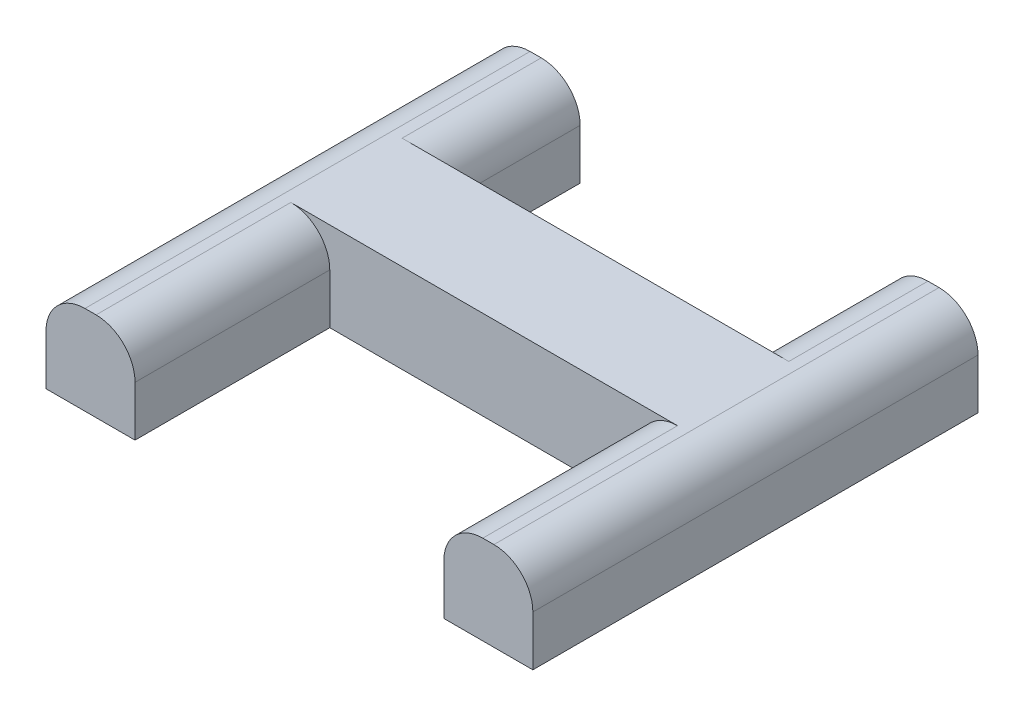
ISO-10303-21;
HEADER;
FILE_DESCRIPTION(('STEP AP214'),'2;1');
FILE_NAME('part.step','',(''),(''),'','','');
FILE_SCHEMA(('AUTOMOTIVE_DESIGN { 1 0 10303 214 1 1 1 1 }'));
ENDSEC;
DATA;
#1=APPLICATION_CONTEXT('core data for automotive mechanical design processes');
#2=APPLICATION_PROTOCOL_DEFINITION('international standard','automotive_design',2000,#1);
#3=PRODUCT_CONTEXT('',#1,'mechanical');
#4=PRODUCT('Part','Part','',(#3));
#5=PRODUCT_RELATED_PRODUCT_CATEGORY('part','',(#4));
#6=PRODUCT_DEFINITION_FORMATION('','',#4);
#7=PRODUCT_DEFINITION_CONTEXT('part definition',#1,'design');
#8=PRODUCT_DEFINITION('design','',#6,#7);
#9=PRODUCT_DEFINITION_SHAPE('','',#8);
#10=(LENGTH_UNIT() NAMED_UNIT(*) SI_UNIT(.MILLI.,.METRE.));
#11=(NAMED_UNIT(*) PLANE_ANGLE_UNIT() SI_UNIT($,.RADIAN.));
#12=(NAMED_UNIT(*) SI_UNIT($,.STERADIAN.) SOLID_ANGLE_UNIT());
#13=UNCERTAINTY_MEASURE_WITH_UNIT(LENGTH_MEASURE(1.E-05),#10,'distance_accuracy_value','');
#14=(GEOMETRIC_REPRESENTATION_CONTEXT(3) GLOBAL_UNCERTAINTY_ASSIGNED_CONTEXT((#13)) GLOBAL_UNIT_ASSIGNED_CONTEXT((#10,
#11,#12)) REPRESENTATION_CONTEXT('',''));
#15=CARTESIAN_POINT('',(0.,0.,0.));
#16=DIRECTION('',(0.,0.,1.));
#17=DIRECTION('',(1.,0.,0.));
#18=AXIS2_PLACEMENT_3D('',#15,#16,#17);
#19=CARTESIAN_POINT('',(0.160971790732811,-0.0999999999999982,2.));
#20=DIRECTION('',(0.,0.,-1.));
#21=DIRECTION('',(-1.,0.,0.));
#22=AXIS2_PLACEMENT_3D('',#19,#20,#21);
#23=CYLINDRICAL_SURFACE('',#22,0.7);
#24=CARTESIAN_POINT('',(0.160971790732811,-0.0999999999999982,5.5));
#25=DIRECTION('',(0.,0.,1.));
#26=DIRECTION('',(-1.,0.,0.));
#27=AXIS2_PLACEMENT_3D('',#24,#25,#26);
#28=CIRCLE('',#27,0.7);
#29=CARTESIAN_POINT('',(0.860971790732811,-0.0999999999999982,5.5));
#30=VERTEX_POINT('',#29);
#31=CARTESIAN_POINT('',(0.160971790732811,0.6,5.5));
#32=VERTEX_POINT('',#31);
#33=EDGE_CURVE('E268',#30,#32,#28,.T.);
#34=ORIENTED_EDGE('',*,*,#33,.F.);
#35=DIRECTION('',(0.,0.,1.));
#36=VECTOR('',#35,1.);
#37=CARTESIAN_POINT('',(0.860971790732811,-0.0999999999999982,5.5));
#38=LINE('',#37,#36);
#39=CARTESIAN_POINT('',(0.860971790732811,-0.0999999999999982,2.));
#40=VERTEX_POINT('',#39);
#41=EDGE_CURVE('E189',#40,#30,#38,.T.);
#42=ORIENTED_EDGE('',*,*,#41,.F.);
#43=CARTESIAN_POINT('',(0.160971790732811,-0.0999999999999982,2.));
#44=DIRECTION('',(0.,0.,-1.));
#45=DIRECTION('',(1.,0.,0.));
#46=AXIS2_PLACEMENT_3D('',#43,#44,#45);
#47=CIRCLE('',#46,0.7);
#48=CARTESIAN_POINT('',(0.160971790732811,0.6,2.));
#49=VERTEX_POINT('',#48);
#50=EDGE_CURVE('E187',#49,#40,#47,.T.);
#51=ORIENTED_EDGE('',*,*,#50,.F.);
#52=DIRECTION('',(0.,0.,-1.));
#53=VECTOR('',#52,1.);
#54=CARTESIAN_POINT('',(0.160971790732811,0.6,2.));
#55=LINE('',#54,#53);
#56=EDGE_CURVE('E170',#32,#49,#55,.T.);
#57=ORIENTED_EDGE('',*,*,#56,.F.);
#58=EDGE_LOOP('',(#34,#42,#51,#57));
#59=FACE_BOUND('',#58,.T.);
#60=ADVANCED_FACE('F16',(#59),#23,.T.);
#61=CARTESIAN_POINT('',(-0.0390282092671897,-0.0999999999999982,2.));
#62=DIRECTION('',(0.,0.,-1.));
#63=DIRECTION('',(-1.,0.,0.));
#64=AXIS2_PLACEMENT_3D('',#61,#62,#63);
#65=CYLINDRICAL_SURFACE('',#64,0.7);
#66=CARTESIAN_POINT('',(-0.0390282092671897,-0.0999999999999982,5.5));
#67=DIRECTION('',(0.,0.,1.));
#68=DIRECTION('',(-1.,0.,0.));
#69=AXIS2_PLACEMENT_3D('',#66,#67,#68);
#70=CIRCLE('',#69,0.7);
#71=CARTESIAN_POINT('',(-0.0390282092671897,0.6,5.5));
#72=VERTEX_POINT('',#71);
#73=CARTESIAN_POINT('',(-0.73902820926719,-0.0999999999999983,5.5));
#74=VERTEX_POINT('',#73);
#75=EDGE_CURVE('E271',#72,#74,#70,.T.);
#76=ORIENTED_EDGE('',*,*,#75,.F.);
#77=DIRECTION('',(0.,0.,1.));
#78=VECTOR('',#77,1.);
#79=CARTESIAN_POINT('',(-0.0390282092671897,0.6,2.));
#80=LINE('',#79,#78);
#81=CARTESIAN_POINT('',(-0.0390282092671899,0.6,-2.5));
#82=VERTEX_POINT('',#81);
#83=EDGE_CURVE('E245',#82,#72,#80,.T.);
#84=ORIENTED_EDGE('',*,*,#83,.F.);
#85=CARTESIAN_POINT('',(-0.0390282092671897,-0.0999999999999982,-2.5));
#86=DIRECTION('',(0.,0.,-1.));
#87=DIRECTION('',(-1.,0.,0.));
#88=AXIS2_PLACEMENT_3D('',#85,#86,#87);
#89=CIRCLE('',#88,0.7);
#90=CARTESIAN_POINT('',(-0.73902820926719,-0.0999999999999983,-2.5));
#91=VERTEX_POINT('',#90);
#92=EDGE_CURVE('E10',#91,#82,#89,.T.);
#93=ORIENTED_EDGE('',*,*,#92,.F.);
#94=DIRECTION('',(0.,0.,-1.));
#95=VECTOR('',#94,1.);
#96=CARTESIAN_POINT('',(-0.73902820926719,-0.0999999999999983,2.));
#97=LINE('',#96,#95);
#98=EDGE_CURVE('E283',#74,#91,#97,.T.);
#99=ORIENTED_EDGE('',*,*,#98,.F.);
#100=EDGE_LOOP('',(#76,#84,#93,#99));
#101=FACE_BOUND('',#100,.T.);
#102=ADVANCED_FACE('F374',(#101),#65,.T.);
#103=CARTESIAN_POINT('',(0.160971790732811,-0.0999999999999982,-2.5));
#104=DIRECTION('',(0.,0.,1.));
#105=DIRECTION('',(1.,0.,0.));
#106=AXIS2_PLACEMENT_3D('',#103,#104,#105);
#107=CYLINDRICAL_SURFACE('',#106,0.7);
#108=CARTESIAN_POINT('',(0.160971790732811,-0.0999999999999982,-2.5));
#109=DIRECTION('',(0.,0.,-1.));
#110=DIRECTION('',(-1.,0.,0.));
#111=AXIS2_PLACEMENT_3D('',#108,#109,#110);
#112=CIRCLE('',#111,0.7);
#113=CARTESIAN_POINT('',(0.16097179073281,0.6,-2.5));
#114=VERTEX_POINT('',#113);
#115=CARTESIAN_POINT('',(0.86097179073281,-0.0999999999999981,-2.5));
#116=VERTEX_POINT('',#115);
#117=EDGE_CURVE('E27',#114,#116,#112,.T.);
#118=ORIENTED_EDGE('',*,*,#117,.F.);
#119=DIRECTION('',(0.,0.,-1.));
#120=VECTOR('',#119,1.);
#121=CARTESIAN_POINT('',(0.160971790732811,0.6,2.));
#122=LINE('',#121,#120);
#123=CARTESIAN_POINT('',(0.160971790732811,0.6,0.));
#124=VERTEX_POINT('',#123);
#125=EDGE_CURVE('E261',#124,#114,#122,.T.);
#126=ORIENTED_EDGE('',*,*,#125,.F.);
#127=CARTESIAN_POINT('',(0.160971790732811,-0.0999999999999982,0.));
#128=DIRECTION('',(0.,0.,1.));
#129=DIRECTION('',(1.,0.,0.));
#130=AXIS2_PLACEMENT_3D('',#127,#128,#129);
#131=CIRCLE('',#130,0.7);
#132=CARTESIAN_POINT('',(0.86097179073281,-0.0999999999999981,0.));
#133=VERTEX_POINT('',#132);
#134=EDGE_CURVE('E222',#133,#124,#131,.T.);
#135=ORIENTED_EDGE('',*,*,#134,.F.);
#136=DIRECTION('',(0.,0.,1.));
#137=VECTOR('',#136,1.);
#138=CARTESIAN_POINT('',(0.86097179073281,-0.0999999999999981,-2.5));
#139=LINE('',#138,#137);
#140=EDGE_CURVE('E297',#116,#133,#139,.T.);
#141=ORIENTED_EDGE('',*,*,#140,.F.);
#142=EDGE_LOOP('',(#118,#126,#135,#141));
#143=FACE_BOUND('',#142,.T.);
#144=ADVANCED_FACE('F441',(#143),#107,.T.);
#145=CARTESIAN_POINT('',(7.11097179073281,-0.0999999999999982,5.5));
#146=DIRECTION('',(0.,0.,-1.));
#147=DIRECTION('',(-1.,0.,0.));
#148=AXIS2_PLACEMENT_3D('',#145,#146,#147);
#149=CYLINDRICAL_SURFACE('',#148,0.7);
#150=CARTESIAN_POINT('',(7.11097179073281,-0.0999999999999982,5.5));
#151=DIRECTION('',(0.,0.,1.));
#152=DIRECTION('',(1.,0.,0.));
#153=AXIS2_PLACEMENT_3D('',#150,#151,#152);
#154=CIRCLE('',#153,0.7);
#155=CARTESIAN_POINT('',(7.11097179073281,0.6,5.5));
#156=VERTEX_POINT('',#155);
#157=CARTESIAN_POINT('',(6.41097179073281,-0.0999999999999982,5.5));
#158=VERTEX_POINT('',#157);
#159=EDGE_CURVE('E390',#156,#158,#154,.T.);
#160=ORIENTED_EDGE('',*,*,#159,.F.);
#161=DIRECTION('',(0.,0.,1.));
#162=VECTOR('',#161,1.);
#163=CARTESIAN_POINT('',(7.11097179073281,0.6,2.));
#164=LINE('',#163,#162);
#165=CARTESIAN_POINT('',(7.11097179073281,0.6,2.));
#166=VERTEX_POINT('',#165);
#167=EDGE_CURVE('E184',#166,#156,#164,.T.);
#168=ORIENTED_EDGE('',*,*,#167,.F.);
#169=CARTESIAN_POINT('',(7.11097179073281,-0.0999999999999982,2.));
#170=DIRECTION('',(0.,0.,-1.));
#171=DIRECTION('',(1.,0.,0.));
#172=AXIS2_PLACEMENT_3D('',#169,#170,#171);
#173=CIRCLE('',#172,0.7);
#174=CARTESIAN_POINT('',(6.41097179073281,-0.0999999999999982,2.));
#175=VERTEX_POINT('',#174);
#176=EDGE_CURVE('E200',#175,#166,#173,.T.);
#177=ORIENTED_EDGE('',*,*,#176,.F.);
#178=DIRECTION('',(0.,0.,-1.));
#179=VECTOR('',#178,1.);
#180=CARTESIAN_POINT('',(6.41097179073281,-0.0999999999999982,5.5));
#181=LINE('',#180,#179);
#182=EDGE_CURVE('E212',#158,#175,#181,.T.);
#183=ORIENTED_EDGE('',*,*,#182,.F.);
#184=EDGE_LOOP('',(#160,#168,#177,#183));
#185=FACE_BOUND('',#184,.T.);
#186=ADVANCED_FACE('F462',(#185),#149,.T.);
#187=CARTESIAN_POINT('',(7.11097179073281,-0.0999999999999982,2.));
#188=DIRECTION('',(0.,0.,1.));
#189=DIRECTION('',(1.,0.,0.));
#190=AXIS2_PLACEMENT_3D('',#187,#188,#189);
#191=CYLINDRICAL_SURFACE('',#190,0.7);
#192=CARTESIAN_POINT('',(7.11097179073281,-0.0999999999999982,-2.5));
#193=DIRECTION('',(0.,0.,-1.));
#194=DIRECTION('',(-1.,0.,0.));
#195=AXIS2_PLACEMENT_3D('',#192,#193,#194);
#196=CIRCLE('',#195,0.7);
#197=CARTESIAN_POINT('',(6.41097179073281,-0.0999999999999982,-2.5));
#198=VERTEX_POINT('',#197);
#199=CARTESIAN_POINT('',(7.11097179073281,0.6,-2.5));
#200=VERTEX_POINT('',#199);
#201=EDGE_CURVE('E385',#198,#200,#196,.T.);
#202=ORIENTED_EDGE('',*,*,#201,.F.);
#203=DIRECTION('',(0.,0.,-1.));
#204=VECTOR('',#203,1.);
#205=CARTESIAN_POINT('',(6.41097179073281,-0.0999999999999982,-2.5));
#206=LINE('',#205,#204);
#207=CARTESIAN_POINT('',(6.41097179073281,-0.0999999999999982,0.));
#208=VERTEX_POINT('',#207);
#209=EDGE_CURVE('E127',#208,#198,#206,.T.);
#210=ORIENTED_EDGE('',*,*,#209,.F.);
#211=CARTESIAN_POINT('',(7.11097179073281,-0.0999999999999982,0.));
#212=DIRECTION('',(0.,0.,1.));
#213=DIRECTION('',(1.,0.,0.));
#214=AXIS2_PLACEMENT_3D('',#211,#212,#213);
#215=CIRCLE('',#214,0.7);
#216=CARTESIAN_POINT('',(7.11097179073281,0.6,0.));
#217=VERTEX_POINT('',#216);
#218=EDGE_CURVE('E221',#217,#208,#215,.T.);
#219=ORIENTED_EDGE('',*,*,#218,.F.);
#220=DIRECTION('',(0.,0.,1.));
#221=VECTOR('',#220,1.);
#222=CARTESIAN_POINT('',(7.11097179073281,0.6,2.));
#223=LINE('',#222,#221);
#224=EDGE_CURVE('E258',#200,#217,#223,.T.);
#225=ORIENTED_EDGE('',*,*,#224,.F.);
#226=EDGE_LOOP('',(#202,#210,#219,#225));
#227=FACE_BOUND('',#226,.T.);
#228=ADVANCED_FACE('F574',(#227),#191,.T.);
#229=CARTESIAN_POINT('',(7.31097179073281,-0.0999999999999982,2.));
#230=DIRECTION('',(0.,0.,-1.));
#231=DIRECTION('',(-1.,0.,0.));
#232=AXIS2_PLACEMENT_3D('',#229,#230,#231);
#233=CYLINDRICAL_SURFACE('',#232,0.7);
#234=CARTESIAN_POINT('',(7.31097179073281,-0.0999999999999982,5.5));
#235=DIRECTION('',(0.,0.,1.));
#236=DIRECTION('',(1.,0.,0.));
#237=AXIS2_PLACEMENT_3D('',#234,#235,#236);
#238=CIRCLE('',#237,0.7);
#239=CARTESIAN_POINT('',(8.01097179073281,-0.0999999999999982,5.5));
#240=VERTEX_POINT('',#239);
#241=CARTESIAN_POINT('',(7.31097179073281,0.6,5.5));
#242=VERTEX_POINT('',#241);
#243=EDGE_CURVE('E20',#240,#242,#238,.T.);
#244=ORIENTED_EDGE('',*,*,#243,.F.);
#245=DIRECTION('',(0.,0.,1.));
#246=VECTOR('',#245,1.);
#247=CARTESIAN_POINT('',(8.01097179073281,-0.0999999999999982,2.));
#248=LINE('',#247,#246);
#249=CARTESIAN_POINT('',(8.01097179073281,-0.0999999999999982,-2.5));
#250=VERTEX_POINT('',#249);
#251=EDGE_CURVE('E254',#250,#240,#248,.T.);
#252=ORIENTED_EDGE('',*,*,#251,.F.);
#253=CARTESIAN_POINT('',(7.31097179073281,-0.0999999999999982,-2.5));
#254=DIRECTION('',(0.,0.,-1.));
#255=DIRECTION('',(-1.,0.,0.));
#256=AXIS2_PLACEMENT_3D('',#253,#254,#255);
#257=CIRCLE('',#256,0.7);
#258=CARTESIAN_POINT('',(7.31097179073281,0.6,-2.5));
#259=VERTEX_POINT('',#258);
#260=EDGE_CURVE('E278',#259,#250,#257,.T.);
#261=ORIENTED_EDGE('',*,*,#260,.F.);
#262=DIRECTION('',(0.,0.,-1.));
#263=VECTOR('',#262,1.);
#264=CARTESIAN_POINT('',(7.31097179073281,0.6,2.));
#265=LINE('',#264,#263);
#266=EDGE_CURVE('E381',#242,#259,#265,.T.);
#267=ORIENTED_EDGE('',*,*,#266,.F.);
#268=EDGE_LOOP('',(#244,#252,#261,#267));
#269=FACE_BOUND('',#268,.T.);
#270=ADVANCED_FACE('F467',(#269),#233,.T.);
#271=CARTESIAN_POINT('',(0.,0.,-2.5));
#272=DIRECTION('',(0.,0.,-1.));
#273=DIRECTION('',(0.,-1.,0.));
#274=AXIS2_PLACEMENT_3D('',#271,#272,#273);
#275=PLANE('',#274);
#276=DIRECTION('',(1.,0.,0.));
#277=VECTOR('',#276,1.);
#278=CARTESIAN_POINT('',(-0.73902820926719,0.6,-2.5));
#279=LINE('',#278,#277);
#280=EDGE_CURVE('E248',#82,#114,#279,.T.);
#281=ORIENTED_EDGE('',*,*,#280,.T.);
#282=ORIENTED_EDGE('',*,*,#117,.T.);
#283=DIRECTION('',(0.,-1.,0.));
#284=VECTOR('',#283,1.);
#285=CARTESIAN_POINT('',(0.860971790732811,-1.,-2.5));
#286=LINE('',#285,#284);
#287=CARTESIAN_POINT('',(0.860971790732811,-1.,-2.5));
#288=VERTEX_POINT('',#287);
#289=EDGE_CURVE('E301',#116,#288,#286,.T.);
#290=ORIENTED_EDGE('',*,*,#289,.T.);
#291=DIRECTION('',(-1.,0.,0.));
#292=VECTOR('',#291,1.);
#293=CARTESIAN_POINT('',(-0.73902820926719,-1.,-2.5));
#294=LINE('',#293,#292);
#295=CARTESIAN_POINT('',(-0.73902820926719,-1.,-2.5));
#296=VERTEX_POINT('',#295);
#297=EDGE_CURVE('E324',#288,#296,#294,.T.);
#298=ORIENTED_EDGE('',*,*,#297,.T.);
#299=DIRECTION('',(0.,1.,0.));
#300=VECTOR('',#299,1.);
#301=CARTESIAN_POINT('',(-0.73902820926719,-1.,-2.5));
#302=LINE('',#301,#300);
#303=EDGE_CURVE('E287',#296,#91,#302,.T.);
#304=ORIENTED_EDGE('',*,*,#303,.T.);
#305=ORIENTED_EDGE('',*,*,#92,.T.);
#306=EDGE_LOOP('',(#281,#282,#290,#298,#304,#305));
#307=FACE_BOUND('',#306,.T.);
#308=ADVANCED_FACE('F581',(#307),#275,.T.);
#309=CARTESIAN_POINT('',(0.860971790732811,-1.,-2.5));
#310=DIRECTION('',(-1.,0.,0.));
#311=DIRECTION('',(0.,1.,0.));
#312=AXIS2_PLACEMENT_3D('',#309,#310,#311);
#313=PLANE('',#312);
#314=ORIENTED_EDGE('',*,*,#289,.F.);
#315=ORIENTED_EDGE('',*,*,#140,.T.);
#316=DIRECTION('',(0.,-1.,0.));
#317=VECTOR('',#316,1.);
#318=CARTESIAN_POINT('',(0.860971790732811,-1.,0.));
#319=LINE('',#318,#317);
#320=CARTESIAN_POINT('',(0.860971790732811,-1.,0.));
#321=VERTEX_POINT('',#320);
#322=EDGE_CURVE('E228',#133,#321,#319,.T.);
#323=ORIENTED_EDGE('',*,*,#322,.T.);
#324=DIRECTION('',(0.,0.,1.));
#325=VECTOR('',#324,1.);
#326=CARTESIAN_POINT('',(0.860971790732811,-1.,-2.5));
#327=LINE('',#326,#325);
#328=EDGE_CURVE('E235',#288,#321,#327,.T.);
#329=ORIENTED_EDGE('',*,*,#328,.F.);
#330=EDGE_LOOP('',(#314,#315,#323,#329));
#331=FACE_BOUND('',#330,.T.);
#332=ADVANCED_FACE('F432',(#331),#313,.F.);
#333=CARTESIAN_POINT('',(0.,0.,-2.5));
#334=DIRECTION('',(0.,0.,-1.));
#335=DIRECTION('',(0.,-1.,0.));
#336=AXIS2_PLACEMENT_3D('',#333,#334,#335);
#337=PLANE('',#336);
#338=DIRECTION('',(1.,0.,0.));
#339=VECTOR('',#338,1.);
#340=CARTESIAN_POINT('',(8.01097179073281,0.6,-2.5));
#341=LINE('',#340,#339);
#342=EDGE_CURVE('E262',#200,#259,#341,.T.);
#343=ORIENTED_EDGE('',*,*,#342,.T.);
#344=ORIENTED_EDGE('',*,*,#260,.T.);
#345=DIRECTION('',(0.,-1.,0.));
#346=VECTOR('',#345,1.);
#347=CARTESIAN_POINT('',(8.01097179073281,0.6,-2.5));
#348=LINE('',#347,#346);
#349=CARTESIAN_POINT('',(8.01097179073281,-1.,-2.5));
#350=VERTEX_POINT('',#349);
#351=EDGE_CURVE('E288',#250,#350,#348,.T.);
#352=ORIENTED_EDGE('',*,*,#351,.T.);
#353=DIRECTION('',(-1.,0.,0.));
#354=VECTOR('',#353,1.);
#355=CARTESIAN_POINT('',(8.01097179073281,-1.,-2.5));
#356=LINE('',#355,#354);
#357=CARTESIAN_POINT('',(6.41097179073281,-1.,-2.5));
#358=VERTEX_POINT('',#357);
#359=EDGE_CURVE('E234',#350,#358,#356,.T.);
#360=ORIENTED_EDGE('',*,*,#359,.T.);
#361=DIRECTION('',(0.,1.,0.));
#362=VECTOR('',#361,1.);
#363=CARTESIAN_POINT('',(6.41097179073281,0.6,-2.5));
#364=LINE('',#363,#362);
#365=EDGE_CURVE('E274',#358,#198,#364,.T.);
#366=ORIENTED_EDGE('',*,*,#365,.T.);
#367=ORIENTED_EDGE('',*,*,#201,.T.);
#368=EDGE_LOOP('',(#343,#344,#352,#360,#366,#367));
#369=FACE_BOUND('',#368,.T.);
#370=ADVANCED_FACE('F411',(#369),#337,.T.);
#371=CARTESIAN_POINT('',(6.41097179073281,0.6,-2.5));
#372=DIRECTION('',(1.,0.,0.));
#373=DIRECTION('',(0.,1.,0.));
#374=AXIS2_PLACEMENT_3D('',#371,#372,#373);
#375=PLANE('',#374);
#376=DIRECTION('',(0.,1.,0.));
#377=VECTOR('',#376,1.);
#378=CARTESIAN_POINT('',(6.41097179073281,0.6,0.));
#379=LINE('',#378,#377);
#380=CARTESIAN_POINT('',(6.41097179073281,-1.,0.));
#381=VERTEX_POINT('',#380);
#382=EDGE_CURVE('E227',#381,#208,#379,.T.);
#383=ORIENTED_EDGE('',*,*,#382,.T.);
#384=ORIENTED_EDGE('',*,*,#209,.T.);
#385=ORIENTED_EDGE('',*,*,#365,.F.);
#386=DIRECTION('',(0.,0.,1.));
#387=VECTOR('',#386,1.);
#388=CARTESIAN_POINT('',(6.41097179073281,-1.,-2.5));
#389=LINE('',#388,#387);
#390=EDGE_CURVE('E138',#358,#381,#389,.T.);
#391=ORIENTED_EDGE('',*,*,#390,.T.);
#392=EDGE_LOOP('',(#383,#384,#385,#391));
#393=FACE_BOUND('',#392,.T.);
#394=ADVANCED_FACE('F422',(#393),#375,.F.);
#395=CARTESIAN_POINT('',(0.,0.,5.5));
#396=DIRECTION('',(0.,0.,1.));
#397=DIRECTION('',(1.,0.,0.));
#398=AXIS2_PLACEMENT_3D('',#395,#396,#397);
#399=PLANE('',#398);
#400=DIRECTION('',(0.,1.,0.));
#401=VECTOR('',#400,1.);
#402=CARTESIAN_POINT('',(8.01097179073281,-1.,5.5));
#403=LINE('',#402,#401);
#404=CARTESIAN_POINT('',(8.01097179073281,-1.,5.5));
#405=VERTEX_POINT('',#404);
#406=EDGE_CURVE('E249',#405,#240,#403,.T.);
#407=ORIENTED_EDGE('',*,*,#406,.T.);
#408=ORIENTED_EDGE('',*,*,#243,.T.);
#409=DIRECTION('',(-1.,0.,0.));
#410=VECTOR('',#409,1.);
#411=CARTESIAN_POINT('',(8.01097179073281,0.6,5.5));
#412=LINE('',#411,#410);
#413=EDGE_CURVE('E307',#242,#156,#412,.T.);
#414=ORIENTED_EDGE('',*,*,#413,.T.);
#415=ORIENTED_EDGE('',*,*,#159,.T.);
#416=DIRECTION('',(0.,-1.,0.));
#417=VECTOR('',#416,1.);
#418=CARTESIAN_POINT('',(6.41097179073281,-1.,5.5));
#419=LINE('',#418,#417);
#420=CARTESIAN_POINT('',(6.41097179073281,-1.,5.5));
#421=VERTEX_POINT('',#420);
#422=EDGE_CURVE('E216',#158,#421,#419,.T.);
#423=ORIENTED_EDGE('',*,*,#422,.T.);
#424=DIRECTION('',(1.,0.,0.));
#425=VECTOR('',#424,1.);
#426=CARTESIAN_POINT('',(8.01097179073281,-1.,5.5));
#427=LINE('',#426,#425);
#428=EDGE_CURVE('E241',#421,#405,#427,.T.);
#429=ORIENTED_EDGE('',*,*,#428,.T.);
#430=EDGE_LOOP('',(#407,#408,#414,#415,#423,#429));
#431=FACE_BOUND('',#430,.T.);
#432=ADVANCED_FACE('F18',(#431),#399,.T.);
#433=CARTESIAN_POINT('',(6.41097179073281,-1.,5.5));
#434=DIRECTION('',(1.,0.,0.));
#435=DIRECTION('',(0.,1.,0.));
#436=AXIS2_PLACEMENT_3D('',#433,#434,#435);
#437=PLANE('',#436);
#438=ORIENTED_EDGE('',*,*,#422,.F.);
#439=ORIENTED_EDGE('',*,*,#182,.T.);
#440=DIRECTION('',(0.,-1.,0.));
#441=VECTOR('',#440,1.);
#442=CARTESIAN_POINT('',(6.41097179073281,-1.,2.));
#443=LINE('',#442,#441);
#444=CARTESIAN_POINT('',(6.41097179073281,-1.,2.));
#445=VERTEX_POINT('',#444);
#446=EDGE_CURVE('E206',#175,#445,#443,.T.);
#447=ORIENTED_EDGE('',*,*,#446,.T.);
#448=DIRECTION('',(0.,0.,-1.));
#449=VECTOR('',#448,1.);
#450=CARTESIAN_POINT('',(6.41097179073281,-1.,5.5));
#451=LINE('',#450,#449);
#452=EDGE_CURVE('E236',#421,#445,#451,.T.);
#453=ORIENTED_EDGE('',*,*,#452,.F.);
#454=EDGE_LOOP('',(#438,#439,#447,#453));
#455=FACE_BOUND('',#454,.T.);
#456=ADVANCED_FACE('F430',(#455),#437,.F.);
#457=CARTESIAN_POINT('',(0.,0.,5.5));
#458=DIRECTION('',(0.,0.,-1.));
#459=DIRECTION('',(0.,-1.,0.));
#460=AXIS2_PLACEMENT_3D('',#457,#458,#459);
#461=PLANE('',#460);
#462=DIRECTION('',(-1.,0.,0.));
#463=VECTOR('',#462,1.);
#464=CARTESIAN_POINT('',(-0.73902820926719,0.6,5.5));
#465=LINE('',#464,#463);
#466=EDGE_CURVE('E180',#32,#72,#465,.T.);
#467=ORIENTED_EDGE('',*,*,#466,.T.);
#468=ORIENTED_EDGE('',*,*,#75,.T.);
#469=DIRECTION('',(0.,-1.,0.));
#470=VECTOR('',#469,1.);
#471=CARTESIAN_POINT('',(-0.73902820926719,-1.,5.5));
#472=LINE('',#471,#470);
#473=CARTESIAN_POINT('',(-0.73902820926719,-1.,5.5));
#474=VERTEX_POINT('',#473);
#475=EDGE_CURVE('E244',#74,#474,#472,.T.);
#476=ORIENTED_EDGE('',*,*,#475,.T.);
#477=DIRECTION('',(1.,0.,0.));
#478=VECTOR('',#477,1.);
#479=CARTESIAN_POINT('',(-0.73902820926719,-1.,5.5));
#480=LINE('',#479,#478);
#481=CARTESIAN_POINT('',(0.860971790732811,-1.,5.5));
#482=VERTEX_POINT('',#481);
#483=EDGE_CURVE('E265',#474,#482,#480,.T.);
#484=ORIENTED_EDGE('',*,*,#483,.T.);
#485=DIRECTION('',(0.,1.,0.));
#486=VECTOR('',#485,1.);
#487=CARTESIAN_POINT('',(0.860971790732811,-1.,5.5));
#488=LINE('',#487,#486);
#489=EDGE_CURVE('E210',#482,#30,#488,.T.);
#490=ORIENTED_EDGE('',*,*,#489,.T.);
#491=ORIENTED_EDGE('',*,*,#33,.T.);
#492=EDGE_LOOP('',(#467,#468,#476,#484,#490,#491));
#493=FACE_BOUND('',#492,.T.);
#494=ADVANCED_FACE('F338',(#493),#461,.F.);
#495=CARTESIAN_POINT('',(0.860971790732811,-1.,5.5));
#496=DIRECTION('',(-1.,0.,0.));
#497=DIRECTION('',(0.,0.,1.));
#498=AXIS2_PLACEMENT_3D('',#495,#496,#497);
#499=PLANE('',#498);
#500=DIRECTION('',(0.,1.,0.));
#501=VECTOR('',#500,1.);
#502=CARTESIAN_POINT('',(0.860971790732811,-1.,2.));
#503=LINE('',#502,#501);
#504=CARTESIAN_POINT('',(0.860971790732811,-1.,2.));
#505=VERTEX_POINT('',#504);
#506=EDGE_CURVE('E194',#505,#40,#503,.T.);
#507=ORIENTED_EDGE('',*,*,#506,.T.);
#508=ORIENTED_EDGE('',*,*,#41,.T.);
#509=ORIENTED_EDGE('',*,*,#489,.F.);
#510=DIRECTION('',(0.,0.,-1.));
#511=VECTOR('',#510,1.);
#512=CARTESIAN_POINT('',(0.860971790732811,-1.,5.5));
#513=LINE('',#512,#511);
#514=EDGE_CURVE('E240',#482,#505,#513,.T.);
#515=ORIENTED_EDGE('',*,*,#514,.T.);
#516=EDGE_LOOP('',(#507,#508,#509,#515));
#517=FACE_BOUND('',#516,.T.);
#518=ADVANCED_FACE('F349',(#517),#499,.F.);
#519=CARTESIAN_POINT('',(0.,-1.,2.));
#520=DIRECTION('',(0.,1.,0.));
#521=DIRECTION('',(1.,0.,0.));
#522=AXIS2_PLACEMENT_3D('',#519,#520,#521);
#523=PLANE('',#522);
#524=DIRECTION('',(0.,0.,-1.));
#525=VECTOR('',#524,1.);
#526=CARTESIAN_POINT('',(-0.73902820926719,-1.,2.));
#527=LINE('',#526,#525);
#528=EDGE_CURVE('E313',#474,#296,#527,.T.);
#529=ORIENTED_EDGE('',*,*,#528,.T.);
#530=ORIENTED_EDGE('',*,*,#297,.F.);
#531=ORIENTED_EDGE('',*,*,#328,.T.);
#532=DIRECTION('',(1.,0.,0.));
#533=VECTOR('',#532,1.);
#534=CARTESIAN_POINT('',(0.,-1.,0.));
#535=LINE('',#534,#533);
#536=EDGE_CURVE('E223',#321,#381,#535,.T.);
#537=ORIENTED_EDGE('',*,*,#536,.T.);
#538=ORIENTED_EDGE('',*,*,#390,.F.);
#539=ORIENTED_EDGE('',*,*,#359,.F.);
#540=DIRECTION('',(0.,0.,-1.));
#541=VECTOR('',#540,1.);
#542=CARTESIAN_POINT('',(8.01097179073281,-1.,2.));
#543=LINE('',#542,#541);
#544=EDGE_CURVE('E253',#405,#350,#543,.T.);
#545=ORIENTED_EDGE('',*,*,#544,.F.);
#546=ORIENTED_EDGE('',*,*,#428,.F.);
#547=ORIENTED_EDGE('',*,*,#452,.T.);
#548=DIRECTION('',(1.,0.,0.));
#549=VECTOR('',#548,1.);
#550=CARTESIAN_POINT('',(0.,-1.,2.));
#551=LINE('',#550,#549);
#552=EDGE_CURVE('E226',#505,#445,#551,.T.);
#553=ORIENTED_EDGE('',*,*,#552,.F.);
#554=ORIENTED_EDGE('',*,*,#514,.F.);
#555=ORIENTED_EDGE('',*,*,#483,.F.);
#556=EDGE_LOOP('',(#529,#530,#531,#537,#538,#539,#545,#546,#547,#553,#554,#555));
#557=FACE_BOUND('',#556,.T.);
#558=ADVANCED_FACE('F347',(#557),#523,.F.);
#559=CARTESIAN_POINT('',(-0.73902820926719,0.,2.));
#560=DIRECTION('',(1.,0.,0.));
#561=DIRECTION('',(0.,1.,0.));
#562=AXIS2_PLACEMENT_3D('',#559,#560,#561);
#563=PLANE('',#562);
#564=ORIENTED_EDGE('',*,*,#475,.F.);
#565=ORIENTED_EDGE('',*,*,#98,.T.);
#566=ORIENTED_EDGE('',*,*,#303,.F.);
#567=ORIENTED_EDGE('',*,*,#528,.F.);
#568=EDGE_LOOP('',(#564,#565,#566,#567));
#569=FACE_BOUND('',#568,.T.);
#570=ADVANCED_FACE('F377',(#569),#563,.F.);
#571=CARTESIAN_POINT('',(0.,0.6,2.));
#572=DIRECTION('',(0.,-1.,0.));
#573=DIRECTION('',(0.,0.,-1.));
#574=AXIS2_PLACEMENT_3D('',#571,#572,#573);
#575=PLANE('',#574);
#576=ORIENTED_EDGE('',*,*,#413,.F.);
#577=ORIENTED_EDGE('',*,*,#266,.T.);
#578=ORIENTED_EDGE('',*,*,#342,.F.);
#579=ORIENTED_EDGE('',*,*,#224,.T.);
#580=DIRECTION('',(-1.,0.,0.));
#581=VECTOR('',#580,1.);
#582=CARTESIAN_POINT('',(0.,0.6,0.));
#583=LINE('',#582,#581);
#584=EDGE_CURVE('E217',#217,#124,#583,.T.);
#585=ORIENTED_EDGE('',*,*,#584,.T.);
#586=ORIENTED_EDGE('',*,*,#125,.T.);
#587=ORIENTED_EDGE('',*,*,#280,.F.);
#588=ORIENTED_EDGE('',*,*,#83,.T.);
#589=ORIENTED_EDGE('',*,*,#466,.F.);
#590=ORIENTED_EDGE('',*,*,#56,.T.);
#591=DIRECTION('',(-1.,0.,0.));
#592=VECTOR('',#591,1.);
#593=CARTESIAN_POINT('',(0.,0.6,2.));
#594=LINE('',#593,#592);
#595=EDGE_CURVE('E176',#166,#49,#594,.T.);
#596=ORIENTED_EDGE('',*,*,#595,.F.);
#597=ORIENTED_EDGE('',*,*,#167,.T.);
#598=EDGE_LOOP('',(#576,#577,#578,#579,#585,#586,#587,#588,#589,#590,#596,#597));
#599=FACE_BOUND('',#598,.T.);
#600=ADVANCED_FACE('F173',(#599),#575,.F.);
#601=CARTESIAN_POINT('',(8.01097179073281,0.,2.));
#602=DIRECTION('',(-1.,0.,0.));
#603=DIRECTION('',(0.,0.,1.));
#604=AXIS2_PLACEMENT_3D('',#601,#602,#603);
#605=PLANE('',#604);
#606=ORIENTED_EDGE('',*,*,#351,.F.);
#607=ORIENTED_EDGE('',*,*,#251,.T.);
#608=ORIENTED_EDGE('',*,*,#406,.F.);
#609=ORIENTED_EDGE('',*,*,#544,.T.);
#610=EDGE_LOOP('',(#606,#607,#608,#609));
#611=FACE_BOUND('',#610,.T.);
#612=ADVANCED_FACE('F446',(#611),#605,.F.);
#613=CARTESIAN_POINT('',(0.,0.,2.));
#614=DIRECTION('',(0.,0.,1.));
#615=DIRECTION('',(1.,0.,0.));
#616=AXIS2_PLACEMENT_3D('',#613,#614,#615);
#617=PLANE('',#616);
#618=ORIENTED_EDGE('',*,*,#552,.T.);
#619=ORIENTED_EDGE('',*,*,#446,.F.);
#620=ORIENTED_EDGE('',*,*,#176,.T.);
#621=ORIENTED_EDGE('',*,*,#595,.T.);
#622=ORIENTED_EDGE('',*,*,#50,.T.);
#623=ORIENTED_EDGE('',*,*,#506,.F.);
#624=EDGE_LOOP('',(#618,#619,#620,#621,#622,#623));
#625=FACE_BOUND('',#624,.T.);
#626=ADVANCED_FACE('F197',(#625),#617,.T.);
#627=CARTESIAN_POINT('',(0.,0.,0.));
#628=DIRECTION('',(0.,0.,1.));
#629=DIRECTION('',(1.,0.,0.));
#630=AXIS2_PLACEMENT_3D('',#627,#628,#629);
#631=PLANE('',#630);
#632=ORIENTED_EDGE('',*,*,#322,.F.);
#633=ORIENTED_EDGE('',*,*,#134,.T.);
#634=ORIENTED_EDGE('',*,*,#584,.F.);
#635=ORIENTED_EDGE('',*,*,#218,.T.);
#636=ORIENTED_EDGE('',*,*,#382,.F.);
#637=ORIENTED_EDGE('',*,*,#536,.F.);
#638=EDGE_LOOP('',(#632,#633,#634,#635,#636,#637));
#639=FACE_BOUND('',#638,.T.);
#640=ADVANCED_FACE('F420',(#639),#631,.F.);
#641=CLOSED_SHELL('',(#60,#102,#144,#186,#228,#270,#308,#332,#370,#394,#432,#456,#494,#518,#558,
#570,#600,#612,#626,#640));
#642=MANIFOLD_SOLID_BREP('B1',#641);
#643=ADVANCED_BREP_SHAPE_REPRESENTATION('',(#18,#642),#14);
#644=SHAPE_DEFINITION_REPRESENTATION(#9,#643);
ENDSEC;
END-ISO-10303-21;
